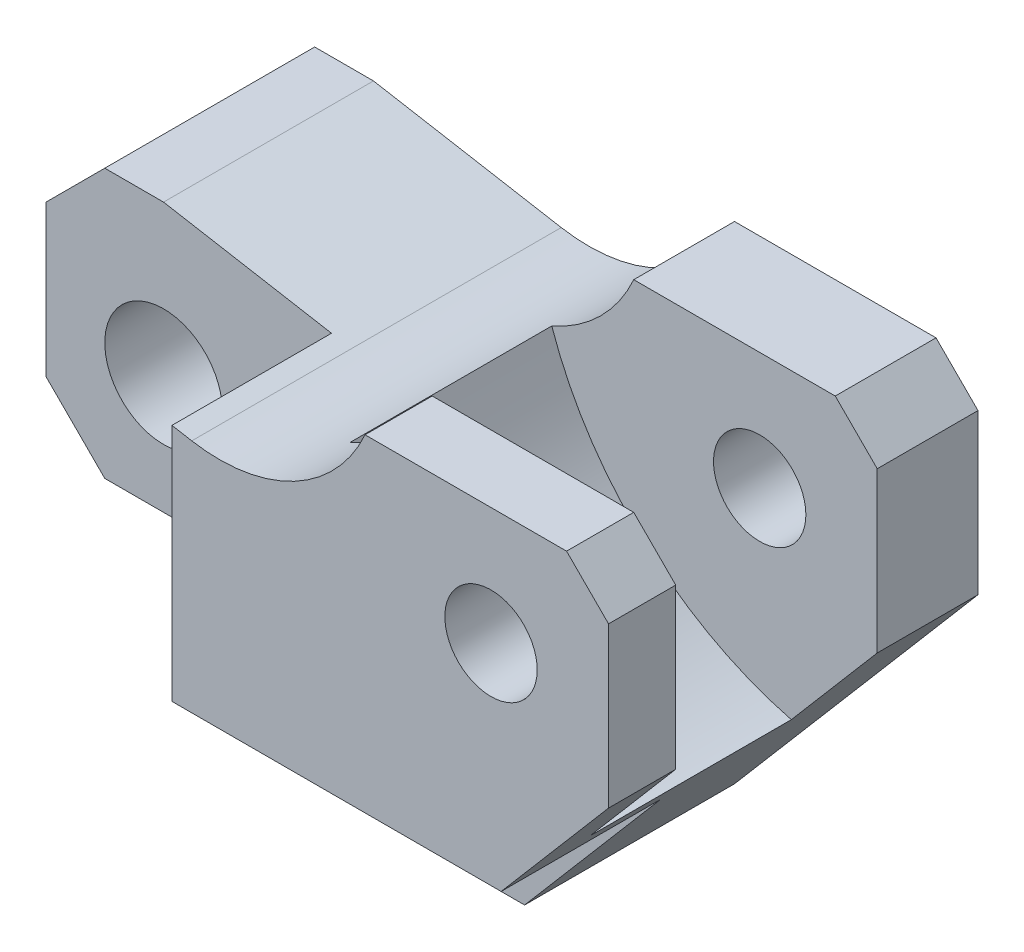
ISO-10303-21;
HEADER;
FILE_DESCRIPTION(('STEP AP214'),'2;1');
FILE_NAME('part.step','',(''),(''),'','','');
FILE_SCHEMA(('AUTOMOTIVE_DESIGN { 1 0 10303 214 1 1 1 1 }'));
ENDSEC;
DATA;
#1=APPLICATION_CONTEXT('core data for automotive mechanical design processes');
#2=APPLICATION_PROTOCOL_DEFINITION('international standard','automotive_design',2000,#1);
#3=PRODUCT_CONTEXT('',#1,'mechanical');
#4=PRODUCT('Part','Part','',(#3));
#5=PRODUCT_RELATED_PRODUCT_CATEGORY('part','',(#4));
#6=PRODUCT_DEFINITION_FORMATION('','',#4);
#7=PRODUCT_DEFINITION_CONTEXT('part definition',#1,'design');
#8=PRODUCT_DEFINITION('design','',#6,#7);
#9=PRODUCT_DEFINITION_SHAPE('','',#8);
#10=(LENGTH_UNIT() NAMED_UNIT(*) SI_UNIT(.MILLI.,.METRE.));
#11=(NAMED_UNIT(*) PLANE_ANGLE_UNIT() SI_UNIT($,.RADIAN.));
#12=(NAMED_UNIT(*) SI_UNIT($,.STERADIAN.) SOLID_ANGLE_UNIT());
#13=UNCERTAINTY_MEASURE_WITH_UNIT(LENGTH_MEASURE(1.E-05),#10,'distance_accuracy_value','');
#14=(GEOMETRIC_REPRESENTATION_CONTEXT(3) GLOBAL_UNCERTAINTY_ASSIGNED_CONTEXT((#13)) GLOBAL_UNIT_ASSIGNED_CONTEXT((#10,
#11,#12)) REPRESENTATION_CONTEXT('',''));
#15=CARTESIAN_POINT('',(0.,0.,0.));
#16=DIRECTION('',(0.,0.,1.));
#17=DIRECTION('',(1.,0.,0.));
#18=AXIS2_PLACEMENT_3D('',#15,#16,#17);
#19=CARTESIAN_POINT('',(-17.3393037885512,65.7684325399872,-44.));
#20=DIRECTION('',(0.,0.,1.));
#21=DIRECTION('',(1.,0.,0.));
#22=AXIS2_PLACEMENT_3D('',#19,#20,#21);
#23=CYLINDRICAL_SURFACE('',#22,19.);
#24=CARTESIAN_POINT('',(-17.3393037885512,65.7684325399872,-32.));
#25=DIRECTION('',(0.,0.,1.));
#26=DIRECTION('',(1.,0.,0.));
#27=AXIS2_PLACEMENT_3D('',#24,#25,#26);
#28=CIRCLE('',#27,19.);
#29=CARTESIAN_POINT('',(-9.76306345097571,48.344294617344,-32.));
#30=VERTEX_POINT('',#29);
#31=CARTESIAN_POINT('',(0.,58.,-32.));
#32=VERTEX_POINT('',#31);
#33=EDGE_CURVE('E245',#30,#32,#28,.T.);
#34=ORIENTED_EDGE('',*,*,#33,.T.);
#35=DIRECTION('',(0.,0.,1.));
#36=VECTOR('',#35,1.);
#37=CARTESIAN_POINT('',(0.,58.,-44.));
#38=LINE('',#37,#36);
#39=CARTESIAN_POINT('',(0.,58.,-44.));
#40=VERTEX_POINT('',#39);
#41=EDGE_CURVE('E412',#40,#32,#38,.T.);
#42=ORIENTED_EDGE('',*,*,#41,.F.);
#43=CARTESIAN_POINT('',(-17.3393037885512,65.7684325399872,-44.));
#44=DIRECTION('',(0.,0.,1.));
#45=DIRECTION('',(1.,0.,0.));
#46=AXIS2_PLACEMENT_3D('',#43,#44,#45);
#47=CIRCLE('',#46,19.);
#48=CARTESIAN_POINT('',(-20.6386191642229,47.0570852327553,-44.));
#49=VERTEX_POINT('',#48);
#50=EDGE_CURVE('E340',#49,#40,#47,.T.);
#51=ORIENTED_EDGE('',*,*,#50,.F.);
#52=DIRECTION('',(0.,0.,1.));
#53=VECTOR('',#52,1.);
#54=CARTESIAN_POINT('',(-20.6386191642229,47.0570852327553,-44.));
#55=LINE('',#54,#53);
#56=CARTESIAN_POINT('',(-20.6386191642229,47.0570852327553,0.));
#57=VERTEX_POINT('',#56);
#58=EDGE_CURVE('E414',#49,#57,#55,.T.);
#59=ORIENTED_EDGE('',*,*,#58,.T.);
#60=CARTESIAN_POINT('',(-17.3393037885512,65.7684325399872,0.));
#61=DIRECTION('',(0.,0.,1.));
#62=DIRECTION('',(1.,0.,0.));
#63=AXIS2_PLACEMENT_3D('',#60,#61,#62);
#64=CIRCLE('',#63,19.);
#65=CARTESIAN_POINT('',(0.,58.,0.));
#66=VERTEX_POINT('',#65);
#67=EDGE_CURVE('E367',#57,#66,#64,.T.);
#68=ORIENTED_EDGE('',*,*,#67,.T.);
#69=CARTESIAN_POINT('',(0.,58.,-8.));
#70=VERTEX_POINT('',#69);
#71=EDGE_CURVE('E411',#70,#66,#38,.T.);
#72=ORIENTED_EDGE('',*,*,#71,.F.);
#73=CARTESIAN_POINT('',(-17.3393037885512,65.7684325399872,-8.));
#74=DIRECTION('',(0.,0.,1.));
#75=DIRECTION('',(1.,0.,0.));
#76=AXIS2_PLACEMENT_3D('',#73,#74,#75);
#77=CIRCLE('',#76,19.);
#78=CARTESIAN_POINT('',(-9.76306345097571,48.344294617344,-8.));
#79=VERTEX_POINT('',#78);
#80=EDGE_CURVE('E269',#79,#70,#77,.T.);
#81=ORIENTED_EDGE('',*,*,#80,.F.);
#82=DIRECTION('',(0.,0.,1.));
#83=VECTOR('',#82,1.);
#84=CARTESIAN_POINT('',(-9.76306345097571,48.344294617344,-32.));
#85=LINE('',#84,#83);
#86=EDGE_CURVE('E261',#30,#79,#85,.T.);
#87=ORIENTED_EDGE('',*,*,#86,.F.);
#88=EDGE_LOOP('',(#34,#42,#51,#59,#68,#72,#81,#87));
#89=FACE_BOUND('',#88,.T.);
#90=ADVANCED_FACE('F88',(#89),#23,.F.);
#91=CARTESIAN_POINT('',(24.,58.,-44.));
#92=DIRECTION('',(0.,1.,0.));
#93=DIRECTION('',(-1.,0.,0.));
#94=AXIS2_PLACEMENT_3D('',#91,#92,#93);
#95=PLANE('',#94);
#96=ORIENTED_EDGE('',*,*,#41,.T.);
#97=DIRECTION('',(-1.,0.,0.));
#98=VECTOR('',#97,1.);
#99=CARTESIAN_POINT('',(0.,58.,-32.));
#100=LINE('',#99,#98);
#101=CARTESIAN_POINT('',(24.,58.,-32.));
#102=VERTEX_POINT('',#101);
#103=EDGE_CURVE('E251',#102,#32,#100,.T.);
#104=ORIENTED_EDGE('',*,*,#103,.F.);
#105=DIRECTION('',(0.,0.,1.));
#106=VECTOR('',#105,1.);
#107=CARTESIAN_POINT('',(24.,58.,-44.));
#108=LINE('',#107,#106);
#109=CARTESIAN_POINT('',(24.,58.,-44.));
#110=VERTEX_POINT('',#109);
#111=EDGE_CURVE('E408',#110,#102,#108,.T.);
#112=ORIENTED_EDGE('',*,*,#111,.F.);
#113=DIRECTION('',(-1.,0.,0.));
#114=VECTOR('',#113,1.);
#115=CARTESIAN_POINT('',(24.,58.,-44.));
#116=LINE('',#115,#114);
#117=EDGE_CURVE('E342',#110,#40,#116,.T.);
#118=ORIENTED_EDGE('',*,*,#117,.T.);
#119=EDGE_LOOP('',(#96,#104,#112,#118));
#120=FACE_BOUND('',#119,.T.);
#121=ADVANCED_FACE('F517',(#120),#95,.T.);
#122=CARTESIAN_POINT('',(29.,53.,-44.));
#123=DIRECTION('',(0.707106781186549,0.707106781186546,0.));
#124=DIRECTION('',(-0.707106781186546,0.707106781186549,0.));
#125=AXIS2_PLACEMENT_3D('',#122,#123,#124);
#126=PLANE('',#125);
#127=ORIENTED_EDGE('',*,*,#111,.T.);
#128=DIRECTION('',(-0.707106781186546,0.707106781186549,0.));
#129=VECTOR('',#128,1.);
#130=CARTESIAN_POINT('',(41.0000000000001,40.9999999999999,-32.));
#131=LINE('',#130,#129);
#132=CARTESIAN_POINT('',(29.,53.,-32.));
#133=VERTEX_POINT('',#132);
#134=EDGE_CURVE('E273',#133,#102,#131,.T.);
#135=ORIENTED_EDGE('',*,*,#134,.F.);
#136=DIRECTION('',(0.,0.,1.));
#137=VECTOR('',#136,1.);
#138=CARTESIAN_POINT('',(29.,53.,-44.));
#139=LINE('',#138,#137);
#140=CARTESIAN_POINT('',(29.,53.,-44.));
#141=VERTEX_POINT('',#140);
#142=EDGE_CURVE('E404',#141,#133,#139,.T.);
#143=ORIENTED_EDGE('',*,*,#142,.F.);
#144=DIRECTION('',(-0.707106781186546,0.707106781186549,0.));
#145=VECTOR('',#144,1.);
#146=CARTESIAN_POINT('',(29.,53.,-44.));
#147=LINE('',#146,#145);
#148=EDGE_CURVE('E345',#141,#110,#147,.T.);
#149=ORIENTED_EDGE('',*,*,#148,.T.);
#150=EDGE_LOOP('',(#127,#135,#143,#149));
#151=FACE_BOUND('',#150,.T.);
#152=ADVANCED_FACE('F515',(#151),#126,.T.);
#153=CARTESIAN_POINT('',(29.,34.,-44.));
#154=DIRECTION('',(1.,0.,0.));
#155=DIRECTION('',(0.,1.,0.));
#156=AXIS2_PLACEMENT_3D('',#153,#154,#155);
#157=PLANE('',#156);
#158=ORIENTED_EDGE('',*,*,#142,.T.);
#159=DIRECTION('',(0.,1.,0.));
#160=VECTOR('',#159,1.);
#161=CARTESIAN_POINT('',(29.,0.,-32.));
#162=LINE('',#161,#160);
#163=CARTESIAN_POINT('',(29.,34.,-32.));
#164=VERTEX_POINT('',#163);
#165=EDGE_CURVE('E507',#164,#133,#162,.T.);
#166=ORIENTED_EDGE('',*,*,#165,.F.);
#167=DIRECTION('',(0.,0.,1.));
#168=VECTOR('',#167,1.);
#169=CARTESIAN_POINT('',(29.,34.,-44.));
#170=LINE('',#169,#168);
#171=CARTESIAN_POINT('',(29.,34.,-44.));
#172=VERTEX_POINT('',#171);
#173=EDGE_CURVE('E400',#172,#164,#170,.T.);
#174=ORIENTED_EDGE('',*,*,#173,.F.);
#175=DIRECTION('',(0.,1.,0.));
#176=VECTOR('',#175,1.);
#177=CARTESIAN_POINT('',(29.,34.,-44.));
#178=LINE('',#177,#176);
#179=EDGE_CURVE('E348',#172,#141,#178,.T.);
#180=ORIENTED_EDGE('',*,*,#179,.T.);
#181=EDGE_LOOP('',(#158,#166,#174,#180));
#182=FACE_BOUND('',#181,.T.);
#183=ADVANCED_FACE('F512',(#182),#157,.T.);
#184=CARTESIAN_POINT('',(0.,0.,-44.));
#185=DIRECTION('',(0.760833951959086,-0.64894660608275,0.));
#186=DIRECTION('',(0.64894660608275,0.760833951959086,0.));
#187=AXIS2_PLACEMENT_3D('',#184,#185,#186);
#188=PLANE('',#187);
#189=ORIENTED_EDGE('',*,*,#173,.T.);
#190=DIRECTION('',(0.64894660608275,0.760833951959086,0.));
#191=VECTOR('',#190,1.);
#192=CARTESIAN_POINT('',(0.,0.,-32.));
#193=LINE('',#192,#191);
#194=CARTESIAN_POINT('',(18.764705882353,22.,-32.));
#195=VERTEX_POINT('',#194);
#196=EDGE_CURVE('E265',#195,#164,#193,.T.);
#197=ORIENTED_EDGE('',*,*,#196,.F.);
#198=DIRECTION('',(0.,0.,1.));
#199=VECTOR('',#198,1.);
#200=CARTESIAN_POINT('',(18.764705882353,22.,-32.));
#201=LINE('',#200,#199);
#202=CARTESIAN_POINT('',(18.764705882353,22.,-8.));
#203=VERTEX_POINT('',#202);
#204=EDGE_CURVE('E264',#195,#203,#201,.T.);
#205=ORIENTED_EDGE('',*,*,#204,.T.);
#206=DIRECTION('',(0.64894660608275,0.760833951959086,0.));
#207=VECTOR('',#206,1.);
#208=CARTESIAN_POINT('',(0.,0.,-8.));
#209=LINE('',#208,#207);
#210=CARTESIAN_POINT('',(29.,34.,-8.));
#211=VERTEX_POINT('',#210);
#212=EDGE_CURVE('E498',#203,#211,#209,.T.);
#213=ORIENTED_EDGE('',*,*,#212,.T.);
#214=CARTESIAN_POINT('',(29.,34.,0.));
#215=VERTEX_POINT('',#214);
#216=EDGE_CURVE('E399',#211,#215,#170,.T.);
#217=ORIENTED_EDGE('',*,*,#216,.T.);
#218=DIRECTION('',(0.64894660608275,0.760833951959086,0.));
#219=VECTOR('',#218,1.);
#220=CARTESIAN_POINT('',(0.,0.,0.));
#221=LINE('',#220,#219);
#222=CARTESIAN_POINT('',(16.2058823529412,19.,0.));
#223=VERTEX_POINT('',#222);
#224=EDGE_CURVE('E379',#223,#215,#221,.T.);
#225=ORIENTED_EDGE('',*,*,#224,.F.);
#226=DIRECTION('',(0.,0.,1.));
#227=VECTOR('',#226,1.);
#228=CARTESIAN_POINT('',(16.2058823529412,19.,-19.));
#229=LINE('',#228,#227);
#230=CARTESIAN_POINT('',(16.2058823529412,19.,-19.));
#231=VERTEX_POINT('',#230);
#232=EDGE_CURVE('E310',#231,#223,#229,.T.);
#233=ORIENTED_EDGE('',*,*,#232,.F.);
#234=DIRECTION('',(0.64894660608275,0.760833951959086,0.));
#235=VECTOR('',#234,1.);
#236=CARTESIAN_POINT('',(0.,0.,-19.));
#237=LINE('',#236,#235);
#238=CARTESIAN_POINT('',(0.,0.,-19.));
#239=VERTEX_POINT('',#238);
#240=EDGE_CURVE('E323',#239,#231,#237,.T.);
#241=ORIENTED_EDGE('',*,*,#240,.F.);
#242=DIRECTION('',(0.,0.,1.));
#243=VECTOR('',#242,1.);
#244=CARTESIAN_POINT('',(0.,0.,-44.));
#245=LINE('',#244,#243);
#246=CARTESIAN_POINT('',(0.,0.,-44.));
#247=VERTEX_POINT('',#246);
#248=EDGE_CURVE('E396',#247,#239,#245,.T.);
#249=ORIENTED_EDGE('',*,*,#248,.F.);
#250=DIRECTION('',(0.64894660608275,0.760833951959086,0.));
#251=VECTOR('',#250,1.);
#252=CARTESIAN_POINT('',(0.,0.,-44.));
#253=LINE('',#252,#251);
#254=EDGE_CURVE('E351',#247,#172,#253,.T.);
#255=ORIENTED_EDGE('',*,*,#254,.T.);
#256=EDGE_LOOP('',(#189,#197,#205,#213,#217,#225,#233,#241,#249,#255));
#257=FACE_BOUND('',#256,.T.);
#258=ADVANCED_FACE('F475',(#257),#188,.T.);
#259=CARTESIAN_POINT('',(15.,44.,-44.));
#260=DIRECTION('',(0.,0.,1.));
#261=DIRECTION('',(1.,0.,0.));
#262=AXIS2_PLACEMENT_3D('',#259,#260,#261);
#263=CYLINDRICAL_SURFACE('',#262,5.5);
#264=CARTESIAN_POINT('',(15.,44.,-44.));
#265=DIRECTION('',(0.,0.,1.));
#266=DIRECTION('',(1.,0.,0.));
#267=AXIS2_PLACEMENT_3D('',#264,#265,#266);
#268=CIRCLE('',#267,5.5);
#269=CARTESIAN_POINT('',(20.5,44.,-44.));
#270=VERTEX_POINT('',#269);
#271=EDGE_CURVE('E277',#270,#270,#268,.T.);
#272=ORIENTED_EDGE('',*,*,#271,.F.);
#273=EDGE_LOOP('',(#272));
#274=FACE_BOUND('',#273,.T.);
#275=CARTESIAN_POINT('',(15.,44.,-32.));
#276=DIRECTION('',(0.,0.,1.));
#277=DIRECTION('',(1.,0.,0.));
#278=AXIS2_PLACEMENT_3D('',#275,#276,#277);
#279=CIRCLE('',#278,5.5);
#280=CARTESIAN_POINT('',(20.5,44.,-32.));
#281=VERTEX_POINT('',#280);
#282=EDGE_CURVE('E256',#281,#281,#279,.T.);
#283=ORIENTED_EDGE('',*,*,#282,.T.);
#284=EDGE_LOOP('',(#283));
#285=FACE_BOUND('',#284,.T.);
#286=ADVANCED_FACE('F561',(#274,#285),#263,.F.);
#287=CARTESIAN_POINT('',(-57.,26.,-44.));
#288=DIRECTION('',(1.,0.,0.));
#289=DIRECTION('',(0.,1.,0.));
#290=AXIS2_PLACEMENT_3D('',#287,#288,#289);
#291=PLANE('',#290);
#292=DIRECTION('',(0.,1.,0.));
#293=VECTOR('',#292,1.);
#294=CARTESIAN_POINT('',(-57.,0.,-19.));
#295=LINE('',#294,#293);
#296=CARTESIAN_POINT('',(-57.,26.,-19.));
#297=VERTEX_POINT('',#296);
#298=CARTESIAN_POINT('',(-57.,44.,-19.));
#299=VERTEX_POINT('',#298);
#300=EDGE_CURVE('E299',#297,#299,#295,.T.);
#301=ORIENTED_EDGE('',*,*,#300,.T.);
#302=DIRECTION('',(0.,0.,1.));
#303=VECTOR('',#302,1.);
#304=CARTESIAN_POINT('',(-57.,44.,-44.));
#305=LINE('',#304,#303);
#306=CARTESIAN_POINT('',(-57.,44.,-44.));
#307=VERTEX_POINT('',#306);
#308=EDGE_CURVE('E12',#307,#299,#305,.T.);
#309=ORIENTED_EDGE('',*,*,#308,.F.);
#310=DIRECTION('',(0.,1.,0.));
#311=VECTOR('',#310,1.);
#312=CARTESIAN_POINT('',(-57.,26.,-44.));
#313=LINE('',#312,#311);
#314=CARTESIAN_POINT('',(-57.,26.,-44.));
#315=VERTEX_POINT('',#314);
#316=EDGE_CURVE('E331',#315,#307,#313,.T.);
#317=ORIENTED_EDGE('',*,*,#316,.F.);
#318=DIRECTION('',(0.,0.,1.));
#319=VECTOR('',#318,1.);
#320=CARTESIAN_POINT('',(-57.,26.,-44.));
#321=LINE('',#320,#319);
#322=EDGE_CURVE('E365',#315,#297,#321,.T.);
#323=ORIENTED_EDGE('',*,*,#322,.T.);
#324=EDGE_LOOP('',(#301,#309,#317,#323));
#325=FACE_BOUND('',#324,.T.);
#326=ADVANCED_FACE('F90',(#325),#291,.F.);
#327=CARTESIAN_POINT('',(-57.,44.,-44.));
#328=DIRECTION('',(0.707106781186549,-0.707106781186546,0.));
#329=DIRECTION('',(0.707106781186546,0.707106781186549,0.));
#330=AXIS2_PLACEMENT_3D('',#327,#328,#329);
#331=PLANE('',#330);
#332=DIRECTION('',(0.707106781186546,0.707106781186549,0.));
#333=VECTOR('',#332,1.);
#334=CARTESIAN_POINT('',(-50.5000000000001,50.4999999999999,-19.));
#335=LINE('',#334,#333);
#336=CARTESIAN_POINT('',(-50.,51.,-19.));
#337=VERTEX_POINT('',#336);
#338=EDGE_CURVE('E296',#299,#337,#335,.T.);
#339=ORIENTED_EDGE('',*,*,#338,.T.);
#340=DIRECTION('',(0.,0.,1.));
#341=VECTOR('',#340,1.);
#342=CARTESIAN_POINT('',(-50.,51.,-44.));
#343=LINE('',#342,#341);
#344=CARTESIAN_POINT('',(-50.,51.,-44.));
#345=VERTEX_POINT('',#344);
#346=EDGE_CURVE('E96',#345,#337,#343,.T.);
#347=ORIENTED_EDGE('',*,*,#346,.F.);
#348=DIRECTION('',(0.707106781186546,0.707106781186549,0.));
#349=VECTOR('',#348,1.);
#350=CARTESIAN_POINT('',(-57.,44.,-44.));
#351=LINE('',#350,#349);
#352=EDGE_CURVE('E334',#307,#345,#351,.T.);
#353=ORIENTED_EDGE('',*,*,#352,.F.);
#354=ORIENTED_EDGE('',*,*,#308,.T.);
#355=EDGE_LOOP('',(#339,#347,#353,#354));
#356=FACE_BOUND('',#355,.T.);
#357=ADVANCED_FACE('F426',(#356),#331,.F.);
#358=CARTESIAN_POINT('',(-50.,51.,-44.));
#359=DIRECTION('',(0.,-1.,0.));
#360=DIRECTION('',(0.,0.,-1.));
#361=AXIS2_PLACEMENT_3D('',#358,#359,#360);
#362=PLANE('',#361);
#363=DIRECTION('',(1.,0.,0.));
#364=VECTOR('',#363,1.);
#365=CARTESIAN_POINT('',(0.,51.,-19.));
#366=LINE('',#365,#364);
#367=CARTESIAN_POINT('',(-43.,51.,-19.));
#368=VERTEX_POINT('',#367);
#369=EDGE_CURVE('E293',#337,#368,#366,.T.);
#370=ORIENTED_EDGE('',*,*,#369,.T.);
#371=DIRECTION('',(0.,0.,1.));
#372=VECTOR('',#371,1.);
#373=CARTESIAN_POINT('',(-43.,51.,-44.));
#374=LINE('',#373,#372);
#375=CARTESIAN_POINT('',(-43.,51.,-44.));
#376=VERTEX_POINT('',#375);
#377=EDGE_CURVE('E417',#376,#368,#374,.T.);
#378=ORIENTED_EDGE('',*,*,#377,.F.);
#379=DIRECTION('',(1.,0.,0.));
#380=VECTOR('',#379,1.);
#381=CARTESIAN_POINT('',(-50.,51.,-44.));
#382=LINE('',#381,#380);
#383=EDGE_CURVE('E336',#345,#376,#382,.T.);
#384=ORIENTED_EDGE('',*,*,#383,.F.);
#385=ORIENTED_EDGE('',*,*,#346,.T.);
#386=EDGE_LOOP('',(#370,#378,#384,#385));
#387=FACE_BOUND('',#386,.T.);
#388=ADVANCED_FACE('F423',(#387),#362,.F.);
#389=CARTESIAN_POINT('',(-43.,51.,-44.));
#390=DIRECTION('',(-0.17364817766693,-0.984807753012208,0.));
#391=DIRECTION('',(0.984807753012208,-0.17364817766693,0.));
#392=AXIS2_PLACEMENT_3D('',#389,#390,#391);
#393=PLANE('',#392);
#394=DIRECTION('',(0.,0.,1.));
#395=VECTOR('',#394,1.);
#396=CARTESIAN_POINT('',(-23.,47.4734603858307,-19.));
#397=LINE('',#396,#395);
#398=CARTESIAN_POINT('',(-23.,47.4734603858307,-19.));
#399=VERTEX_POINT('',#398);
#400=CARTESIAN_POINT('',(-23.,47.4734603858307,0.));
#401=VERTEX_POINT('',#400);
#402=EDGE_CURVE('E308',#399,#401,#397,.T.);
#403=ORIENTED_EDGE('',*,*,#402,.T.);
#404=DIRECTION('',(0.984807753012208,-0.17364817766693,0.));
#405=VECTOR('',#404,1.);
#406=CARTESIAN_POINT('',(-43.,51.,0.));
#407=LINE('',#406,#405);
#408=EDGE_CURVE('E330',#401,#57,#407,.T.);
#409=ORIENTED_EDGE('',*,*,#408,.T.);
#410=ORIENTED_EDGE('',*,*,#58,.F.);
#411=DIRECTION('',(0.984807753012208,-0.17364817766693,0.));
#412=VECTOR('',#411,1.);
#413=CARTESIAN_POINT('',(-43.,51.,-44.));
#414=LINE('',#413,#412);
#415=EDGE_CURVE('E338',#376,#49,#414,.T.);
#416=ORIENTED_EDGE('',*,*,#415,.F.);
#417=ORIENTED_EDGE('',*,*,#377,.T.);
#418=DIRECTION('',(0.984807753012208,-0.17364817766693,0.));
#419=VECTOR('',#418,1.);
#420=CARTESIAN_POINT('',(7.42490500170159,42.1087287485388,-19.));
#421=LINE('',#420,#419);
#422=EDGE_CURVE('E290',#368,#399,#421,.T.);
#423=ORIENTED_EDGE('',*,*,#422,.T.);
#424=EDGE_LOOP('',(#403,#409,#410,#416,#417,#423));
#425=FACE_BOUND('',#424,.T.);
#426=ADVANCED_FACE('F449',(#425),#393,.F.);
#427=CARTESIAN_POINT('',(0.,0.,-44.));
#428=DIRECTION('',(0.,1.,0.));
#429=DIRECTION('',(0.,0.,1.));
#430=AXIS2_PLACEMENT_3D('',#427,#428,#429);
#431=PLANE('',#430);
#432=DIRECTION('',(-1.,0.,0.));
#433=VECTOR('',#432,1.);
#434=CARTESIAN_POINT('',(0.,0.,-19.));
#435=LINE('',#434,#433);
#436=CARTESIAN_POINT('',(-5.70301994726546,0.,-19.));
#437=VERTEX_POINT('',#436);
#438=EDGE_CURVE('E320',#239,#437,#435,.T.);
#439=ORIENTED_EDGE('',*,*,#438,.T.);
#440=DIRECTION('',(0.,0.,1.));
#441=VECTOR('',#440,1.);
#442=CARTESIAN_POINT('',(-5.70301994726546,0.,-44.));
#443=LINE('',#442,#441);
#444=CARTESIAN_POINT('',(-5.70301994726546,0.,-44.));
#445=VERTEX_POINT('',#444);
#446=EDGE_CURVE('E393',#445,#437,#443,.T.);
#447=ORIENTED_EDGE('',*,*,#446,.F.);
#448=DIRECTION('',(-1.,0.,0.));
#449=VECTOR('',#448,1.);
#450=CARTESIAN_POINT('',(0.,0.,-44.));
#451=LINE('',#450,#449);
#452=EDGE_CURVE('E354',#247,#445,#451,.T.);
#453=ORIENTED_EDGE('',*,*,#452,.F.);
#454=ORIENTED_EDGE('',*,*,#248,.T.);
#455=EDGE_LOOP('',(#439,#447,#453,#454));
#456=FACE_BOUND('',#455,.T.);
#457=ADVANCED_FACE('F471',(#456),#431,.F.);
#458=CARTESIAN_POINT('',(16.2058823529412,19.,-44.));
#459=DIRECTION('',(0.,0.,1.));
#460=DIRECTION('',(1.,0.,0.));
#461=AXIS2_PLACEMENT_3D('',#458,#459,#460);
#462=CYLINDRICAL_SURFACE('',#461,29.);
#463=ORIENTED_EDGE('',*,*,#446,.T.);
#464=CARTESIAN_POINT('',(16.2058823529412,19.,-19.));
#465=DIRECTION('',(0.,0.,1.));
#466=DIRECTION('',(1.,0.,0.));
#467=AXIS2_PLACEMENT_3D('',#464,#465,#466);
#468=CIRCLE('',#467,29.);
#469=CARTESIAN_POINT('',(-12.4788223472475,14.7352941176471,-19.));
#470=VERTEX_POINT('',#469);
#471=EDGE_CURVE('E318',#470,#437,#468,.T.);
#472=ORIENTED_EDGE('',*,*,#471,.F.);
#473=DIRECTION('',(0.,0.,1.));
#474=VECTOR('',#473,1.);
#475=CARTESIAN_POINT('',(-12.4788223472475,14.7352941176471,-44.));
#476=LINE('',#475,#474);
#477=CARTESIAN_POINT('',(-12.4788223472475,14.7352941176471,-44.));
#478=VERTEX_POINT('',#477);
#479=EDGE_CURVE('E390',#478,#470,#476,.T.);
#480=ORIENTED_EDGE('',*,*,#479,.F.);
#481=CARTESIAN_POINT('',(16.2058823529412,19.,-44.));
#482=DIRECTION('',(0.,0.,1.));
#483=DIRECTION('',(1.,0.,0.));
#484=AXIS2_PLACEMENT_3D('',#481,#482,#483);
#485=CIRCLE('',#484,29.);
#486=EDGE_CURVE('E356',#478,#445,#485,.T.);
#487=ORIENTED_EDGE('',*,*,#486,.T.);
#488=EDGE_LOOP('',(#463,#472,#480,#487));
#489=FACE_BOUND('',#488,.T.);
#490=ADVANCED_FACE('F467',(#489),#462,.T.);
#491=CARTESIAN_POINT('',(-17.4244610886593,14.,-44.));
#492=DIRECTION('',(0.,0.,1.));
#493=DIRECTION('',(1.,0.,0.));
#494=AXIS2_PLACEMENT_3D('',#491,#492,#493);
#495=CYLINDRICAL_SURFACE('',#494,5.);
#496=CARTESIAN_POINT('',(-17.4244610886593,14.,-19.));
#497=DIRECTION('',(0.,0.,1.));
#498=DIRECTION('',(1.,0.,0.));
#499=AXIS2_PLACEMENT_3D('',#496,#497,#498);
#500=CIRCLE('',#499,5.);
#501=CARTESIAN_POINT('',(-17.4244610886593,19.,-19.));
#502=VERTEX_POINT('',#501);
#503=EDGE_CURVE('E280',#470,#502,#500,.T.);
#504=ORIENTED_EDGE('',*,*,#503,.T.);
#505=DIRECTION('',(0.,0.,1.));
#506=VECTOR('',#505,1.);
#507=CARTESIAN_POINT('',(-17.4244610886593,19.,-44.));
#508=LINE('',#507,#506);
#509=CARTESIAN_POINT('',(-17.4244610886593,19.,-44.));
#510=VERTEX_POINT('',#509);
#511=EDGE_CURVE('E387',#510,#502,#508,.T.);
#512=ORIENTED_EDGE('',*,*,#511,.F.);
#513=CARTESIAN_POINT('',(-17.4244610886593,14.,-44.));
#514=DIRECTION('',(0.,0.,1.));
#515=DIRECTION('',(1.,0.,0.));
#516=AXIS2_PLACEMENT_3D('',#513,#514,#515);
#517=CIRCLE('',#516,5.);
#518=EDGE_CURVE('E359',#478,#510,#517,.T.);
#519=ORIENTED_EDGE('',*,*,#518,.F.);
#520=ORIENTED_EDGE('',*,*,#479,.T.);
#521=EDGE_LOOP('',(#504,#512,#519,#520));
#522=FACE_BOUND('',#521,.T.);
#523=ADVANCED_FACE('F462',(#522),#495,.F.);
#524=CARTESIAN_POINT('',(-17.4244610886593,19.,-44.));
#525=DIRECTION('',(0.,1.,0.));
#526=DIRECTION('',(0.,0.,1.));
#527=AXIS2_PLACEMENT_3D('',#524,#525,#526);
#528=PLANE('',#527);
#529=DIRECTION('',(0.,0.,1.));
#530=VECTOR('',#529,1.);
#531=CARTESIAN_POINT('',(-23.,19.,-19.));
#532=LINE('',#531,#530);
#533=CARTESIAN_POINT('',(-23.,19.,-19.));
#534=VERTEX_POINT('',#533);
#535=CARTESIAN_POINT('',(-23.,19.,0.));
#536=VERTEX_POINT('',#535);
#537=EDGE_CURVE('E311',#534,#536,#532,.T.);
#538=ORIENTED_EDGE('',*,*,#537,.F.);
#539=DIRECTION('',(-1.,0.,0.));
#540=VECTOR('',#539,1.);
#541=CARTESIAN_POINT('',(0.,19.,-19.));
#542=LINE('',#541,#540);
#543=CARTESIAN_POINT('',(-50.,19.,-19.));
#544=VERTEX_POINT('',#543);
#545=EDGE_CURVE('E305',#534,#544,#542,.T.);
#546=ORIENTED_EDGE('',*,*,#545,.T.);
#547=DIRECTION('',(0.,0.,1.));
#548=VECTOR('',#547,1.);
#549=CARTESIAN_POINT('',(-50.,19.,-44.));
#550=LINE('',#549,#548);
#551=CARTESIAN_POINT('',(-50.,19.,-44.));
#552=VERTEX_POINT('',#551);
#553=EDGE_CURVE('E384',#552,#544,#550,.T.);
#554=ORIENTED_EDGE('',*,*,#553,.F.);
#555=DIRECTION('',(-1.,0.,0.));
#556=VECTOR('',#555,1.);
#557=CARTESIAN_POINT('',(-17.4244610886593,19.,-44.));
#558=LINE('',#557,#556);
#559=EDGE_CURVE('E361',#510,#552,#558,.T.);
#560=ORIENTED_EDGE('',*,*,#559,.F.);
#561=ORIENTED_EDGE('',*,*,#511,.T.);
#562=DIRECTION('',(-1.,0.,0.));
#563=VECTOR('',#562,1.);
#564=CARTESIAN_POINT('',(0.,19.,-19.));
#565=LINE('',#564,#563);
#566=EDGE_CURVE('E325',#231,#502,#565,.T.);
#567=ORIENTED_EDGE('',*,*,#566,.F.);
#568=ORIENTED_EDGE('',*,*,#232,.T.);
#569=DIRECTION('',(-1.,0.,0.));
#570=VECTOR('',#569,1.);
#571=CARTESIAN_POINT('',(-17.4244610886593,19.,0.));
#572=LINE('',#571,#570);
#573=EDGE_CURVE('E111',#223,#536,#572,.T.);
#574=ORIENTED_EDGE('',*,*,#573,.T.);
#575=EDGE_LOOP('',(#538,#546,#554,#560,#561,#567,#568,#574));
#576=FACE_BOUND('',#575,.T.);
#577=ADVANCED_FACE('F440',(#576),#528,.F.);
#578=CARTESIAN_POINT('',(-50.,19.,-44.));
#579=DIRECTION('',(0.707106781186548,0.707106781186547,0.));
#580=DIRECTION('',(-0.707106781186547,0.707106781186548,0.));
#581=AXIS2_PLACEMENT_3D('',#578,#579,#580);
#582=PLANE('',#581);
#583=DIRECTION('',(-0.707106781186547,0.707106781186548,0.));
#584=VECTOR('',#583,1.);
#585=CARTESIAN_POINT('',(-15.5,-15.5,-19.));
#586=LINE('',#585,#584);
#587=EDGE_CURVE('E302',#544,#297,#586,.T.);
#588=ORIENTED_EDGE('',*,*,#587,.T.);
#589=ORIENTED_EDGE('',*,*,#322,.F.);
#590=DIRECTION('',(-0.707106781186547,0.707106781186548,0.));
#591=VECTOR('',#590,1.);
#592=CARTESIAN_POINT('',(-50.,19.,-44.));
#593=LINE('',#592,#591);
#594=EDGE_CURVE('E363',#552,#315,#593,.T.);
#595=ORIENTED_EDGE('',*,*,#594,.F.);
#596=ORIENTED_EDGE('',*,*,#553,.T.);
#597=EDGE_LOOP('',(#588,#589,#595,#596));
#598=FACE_BOUND('',#597,.T.);
#599=ADVANCED_FACE('F436',(#598),#582,.F.);
#600=CARTESIAN_POINT('',(-17.3393037885512,65.7684325399872,0.));
#601=DIRECTION('',(0.,0.,1.));
#602=DIRECTION('',(1.,0.,0.));
#603=AXIS2_PLACEMENT_3D('',#600,#601,#602);
#604=PLANE('',#603);
#605=CARTESIAN_POINT('',(15.,44.,0.));
#606=DIRECTION('',(0.,0.,1.));
#607=DIRECTION('',(1.,0.,0.));
#608=AXIS2_PLACEMENT_3D('',#605,#606,#607);
#609=CIRCLE('',#608,5.5);
#610=CARTESIAN_POINT('',(20.5,44.,0.));
#611=VERTEX_POINT('',#610);
#612=EDGE_CURVE('E271',#611,#611,#609,.T.);
#613=ORIENTED_EDGE('',*,*,#612,.F.);
#614=EDGE_LOOP('',(#613));
#615=FACE_BOUND('',#614,.T.);
#616=ORIENTED_EDGE('',*,*,#408,.F.);
#617=DIRECTION('',(0.,-1.,0.));
#618=VECTOR('',#617,1.);
#619=CARTESIAN_POINT('',(-23.,0.,0.));
#620=LINE('',#619,#618);
#621=EDGE_CURVE('E287',#401,#536,#620,.T.);
#622=ORIENTED_EDGE('',*,*,#621,.T.);
#623=ORIENTED_EDGE('',*,*,#573,.F.);
#624=ORIENTED_EDGE('',*,*,#224,.T.);
#625=DIRECTION('',(0.,1.,0.));
#626=VECTOR('',#625,1.);
#627=CARTESIAN_POINT('',(29.,34.,0.));
#628=LINE('',#627,#626);
#629=CARTESIAN_POINT('',(29.,53.,0.));
#630=VERTEX_POINT('',#629);
#631=EDGE_CURVE('E376',#215,#630,#628,.T.);
#632=ORIENTED_EDGE('',*,*,#631,.T.);
#633=DIRECTION('',(-0.707106781186546,0.707106781186549,0.));
#634=VECTOR('',#633,1.);
#635=CARTESIAN_POINT('',(29.,53.,0.));
#636=LINE('',#635,#634);
#637=CARTESIAN_POINT('',(24.,58.,0.));
#638=VERTEX_POINT('',#637);
#639=EDGE_CURVE('E373',#630,#638,#636,.T.);
#640=ORIENTED_EDGE('',*,*,#639,.T.);
#641=DIRECTION('',(-1.,0.,0.));
#642=VECTOR('',#641,1.);
#643=CARTESIAN_POINT('',(24.,58.,0.));
#644=LINE('',#643,#642);
#645=EDGE_CURVE('E370',#638,#66,#644,.T.);
#646=ORIENTED_EDGE('',*,*,#645,.T.);
#647=ORIENTED_EDGE('',*,*,#67,.F.);
#648=EDGE_LOOP('',(#616,#622,#623,#624,#632,#640,#646,#647));
#649=FACE_BOUND('',#648,.T.);
#650=ADVANCED_FACE('F445',(#615,#649),#604,.T.);
#651=CARTESIAN_POINT('',(-43.,33.,-44.));
#652=DIRECTION('',(0.,0.,1.));
#653=DIRECTION('',(1.,0.,0.));
#654=AXIS2_PLACEMENT_3D('',#651,#652,#653);
#655=CYLINDRICAL_SURFACE('',#654,7.);
#656=CARTESIAN_POINT('',(-43.,33.,-44.));
#657=DIRECTION('',(0.,0.,1.));
#658=DIRECTION('',(1.,0.,0.));
#659=AXIS2_PLACEMENT_3D('',#656,#657,#658);
#660=CIRCLE('',#659,7.);
#661=CARTESIAN_POINT('',(-36.,33.,-44.));
#662=VERTEX_POINT('',#661);
#663=EDGE_CURVE('E313',#662,#662,#660,.T.);
#664=ORIENTED_EDGE('',*,*,#663,.F.);
#665=EDGE_LOOP('',(#664));
#666=FACE_BOUND('',#665,.T.);
#667=CARTESIAN_POINT('',(-43.,33.,-19.));
#668=DIRECTION('',(0.,0.,1.));
#669=DIRECTION('',(1.,0.,0.));
#670=AXIS2_PLACEMENT_3D('',#667,#668,#669);
#671=CIRCLE('',#670,7.);
#672=CARTESIAN_POINT('',(-36.,33.,-19.));
#673=VERTEX_POINT('',#672);
#674=EDGE_CURVE('E283',#673,#673,#671,.T.);
#675=ORIENTED_EDGE('',*,*,#674,.T.);
#676=EDGE_LOOP('',(#675));
#677=FACE_BOUND('',#676,.T.);
#678=ADVANCED_FACE('F527',(#666,#677),#655,.F.);
#679=DIRECTION('',(-1.,0.,0.));
#680=VECTOR('',#679,1.);
#681=CARTESIAN_POINT('',(0.,58.,-8.));
#682=LINE('',#681,#680);
#683=CARTESIAN_POINT('',(24.,58.,-8.));
#684=VERTEX_POINT('',#683);
#685=EDGE_CURVE('E491',#684,#70,#682,.T.);
#686=ORIENTED_EDGE('',*,*,#685,.T.);
#687=ORIENTED_EDGE('',*,*,#71,.T.);
#688=ORIENTED_EDGE('',*,*,#645,.F.);
#689=EDGE_CURVE('E407',#684,#638,#108,.T.);
#690=ORIENTED_EDGE('',*,*,#689,.F.);
#691=EDGE_LOOP('',(#686,#687,#688,#690));
#692=FACE_BOUND('',#691,.T.);
#693=ADVANCED_FACE('F490',(#692),#95,.T.);
#694=DIRECTION('',(-0.707106781186546,0.707106781186549,0.));
#695=VECTOR('',#694,1.);
#696=CARTESIAN_POINT('',(41.0000000000001,40.9999999999999,-8.));
#697=LINE('',#696,#695);
#698=CARTESIAN_POINT('',(29.,53.,-8.));
#699=VERTEX_POINT('',#698);
#700=EDGE_CURVE('E492',#699,#684,#697,.T.);
#701=ORIENTED_EDGE('',*,*,#700,.T.);
#702=ORIENTED_EDGE('',*,*,#689,.T.);
#703=ORIENTED_EDGE('',*,*,#639,.F.);
#704=EDGE_CURVE('E403',#699,#630,#139,.T.);
#705=ORIENTED_EDGE('',*,*,#704,.F.);
#706=EDGE_LOOP('',(#701,#702,#703,#705));
#707=FACE_BOUND('',#706,.T.);
#708=ADVANCED_FACE('F485',(#707),#126,.T.);
#709=DIRECTION('',(0.,1.,0.));
#710=VECTOR('',#709,1.);
#711=CARTESIAN_POINT('',(29.,0.,-8.));
#712=LINE('',#711,#710);
#713=EDGE_CURVE('E103',#211,#699,#712,.T.);
#714=ORIENTED_EDGE('',*,*,#713,.T.);
#715=ORIENTED_EDGE('',*,*,#704,.T.);
#716=ORIENTED_EDGE('',*,*,#631,.F.);
#717=ORIENTED_EDGE('',*,*,#216,.F.);
#718=EDGE_LOOP('',(#714,#715,#716,#717));
#719=FACE_BOUND('',#718,.T.);
#720=ADVANCED_FACE('F480',(#719),#157,.T.);
#721=CARTESIAN_POINT('',(-17.3393037885512,65.7684325399872,-44.));
#722=DIRECTION('',(0.,0.,1.));
#723=DIRECTION('',(1.,0.,0.));
#724=AXIS2_PLACEMENT_3D('',#721,#722,#723);
#725=PLANE('',#724);
#726=ORIENTED_EDGE('',*,*,#271,.T.);
#727=EDGE_LOOP('',(#726));
#728=FACE_BOUND('',#727,.T.);
#729=ORIENTED_EDGE('',*,*,#663,.T.);
#730=EDGE_LOOP('',(#729));
#731=FACE_BOUND('',#730,.T.);
#732=ORIENTED_EDGE('',*,*,#316,.T.);
#733=ORIENTED_EDGE('',*,*,#352,.T.);
#734=ORIENTED_EDGE('',*,*,#383,.T.);
#735=ORIENTED_EDGE('',*,*,#415,.T.);
#736=ORIENTED_EDGE('',*,*,#50,.T.);
#737=ORIENTED_EDGE('',*,*,#117,.F.);
#738=ORIENTED_EDGE('',*,*,#148,.F.);
#739=ORIENTED_EDGE('',*,*,#179,.F.);
#740=ORIENTED_EDGE('',*,*,#254,.F.);
#741=ORIENTED_EDGE('',*,*,#452,.T.);
#742=ORIENTED_EDGE('',*,*,#486,.F.);
#743=ORIENTED_EDGE('',*,*,#518,.T.);
#744=ORIENTED_EDGE('',*,*,#559,.T.);
#745=ORIENTED_EDGE('',*,*,#594,.T.);
#746=EDGE_LOOP('',(#732,#733,#734,#735,#736,#737,#738,#739,#740,#741,#742,#743,#744,#745));
#747=FACE_BOUND('',#746,.T.);
#748=ADVANCED_FACE('F454',(#728,#731,#747),#725,.F.);
#749=CARTESIAN_POINT('',(-23.,0.,-19.));
#750=DIRECTION('',(-1.,0.,0.));
#751=DIRECTION('',(0.,-1.,0.));
#752=AXIS2_PLACEMENT_3D('',#749,#750,#751);
#753=PLANE('',#752);
#754=ORIENTED_EDGE('',*,*,#621,.F.);
#755=ORIENTED_EDGE('',*,*,#402,.F.);
#756=DIRECTION('',(0.,-1.,0.));
#757=VECTOR('',#756,1.);
#758=CARTESIAN_POINT('',(-23.,0.,-19.));
#759=LINE('',#758,#757);
#760=EDGE_CURVE('E286',#399,#534,#759,.T.);
#761=ORIENTED_EDGE('',*,*,#760,.T.);
#762=ORIENTED_EDGE('',*,*,#537,.T.);
#763=EDGE_LOOP('',(#754,#755,#761,#762));
#764=FACE_BOUND('',#763,.T.);
#765=ADVANCED_FACE('F443',(#764),#753,.T.);
#766=CARTESIAN_POINT('',(0.,0.,-19.));
#767=DIRECTION('',(0.,0.,1.));
#768=DIRECTION('',(1.,0.,0.));
#769=AXIS2_PLACEMENT_3D('',#766,#767,#768);
#770=PLANE('',#769);
#771=ORIENTED_EDGE('',*,*,#674,.F.);
#772=EDGE_LOOP('',(#771));
#773=FACE_BOUND('',#772,.T.);
#774=ORIENTED_EDGE('',*,*,#760,.F.);
#775=ORIENTED_EDGE('',*,*,#422,.F.);
#776=ORIENTED_EDGE('',*,*,#369,.F.);
#777=ORIENTED_EDGE('',*,*,#338,.F.);
#778=ORIENTED_EDGE('',*,*,#300,.F.);
#779=ORIENTED_EDGE('',*,*,#587,.F.);
#780=ORIENTED_EDGE('',*,*,#545,.F.);
#781=EDGE_LOOP('',(#774,#775,#776,#777,#778,#779,#780));
#782=FACE_BOUND('',#781,.T.);
#783=ADVANCED_FACE('F430',(#773,#782),#770,.T.);
#784=CARTESIAN_POINT('',(0.,0.,-19.));
#785=DIRECTION('',(0.,0.,1.));
#786=DIRECTION('',(1.,0.,0.));
#787=AXIS2_PLACEMENT_3D('',#784,#785,#786);
#788=PLANE('',#787);
#789=ORIENTED_EDGE('',*,*,#503,.F.);
#790=ORIENTED_EDGE('',*,*,#471,.T.);
#791=ORIENTED_EDGE('',*,*,#438,.F.);
#792=ORIENTED_EDGE('',*,*,#240,.T.);
#793=ORIENTED_EDGE('',*,*,#566,.T.);
#794=EDGE_LOOP('',(#789,#790,#791,#792,#793));
#795=FACE_BOUND('',#794,.T.);
#796=ADVANCED_FACE('F465',(#795),#788,.T.);
#797=CARTESIAN_POINT('',(15.,44.,-8.));
#798=DIRECTION('',(0.,0.,1.));
#799=DIRECTION('',(1.,0.,0.));
#800=AXIS2_PLACEMENT_3D('',#797,#798,#799);
#801=CIRCLE('',#800,5.5);
#802=CARTESIAN_POINT('',(20.5,44.,-8.));
#803=VERTEX_POINT('',#802);
#804=EDGE_CURVE('E503',#803,#803,#801,.T.);
#805=ORIENTED_EDGE('',*,*,#804,.F.);
#806=EDGE_LOOP('',(#805));
#807=FACE_BOUND('',#806,.T.);
#808=ORIENTED_EDGE('',*,*,#612,.T.);
#809=EDGE_LOOP('',(#808));
#810=FACE_BOUND('',#809,.T.);
#811=ADVANCED_FACE('F583',(#807,#810),#263,.F.);
#812=CARTESIAN_POINT('',(29.,61.7018734359634,-32.));
#813=DIRECTION('',(0.,0.,1.));
#814=DIRECTION('',(1.,0.,0.));
#815=AXIS2_PLACEMENT_3D('',#812,#813,#814);
#816=CYLINDRICAL_SURFACE('',#815,41.);
#817=CARTESIAN_POINT('',(29.,61.7018734359634,-8.));
#818=DIRECTION('',(0.,0.,1.));
#819=DIRECTION('',(1.,0.,0.));
#820=AXIS2_PLACEMENT_3D('',#817,#818,#819);
#821=CIRCLE('',#820,41.);
#822=EDGE_CURVE('E500',#79,#203,#821,.T.);
#823=ORIENTED_EDGE('',*,*,#822,.T.);
#824=ORIENTED_EDGE('',*,*,#204,.F.);
#825=CARTESIAN_POINT('',(29.,61.7018734359634,-32.));
#826=DIRECTION('',(0.,0.,1.));
#827=DIRECTION('',(1.,0.,0.));
#828=AXIS2_PLACEMENT_3D('',#825,#826,#827);
#829=CIRCLE('',#828,41.);
#830=EDGE_CURVE('E248',#30,#195,#829,.T.);
#831=ORIENTED_EDGE('',*,*,#830,.F.);
#832=ORIENTED_EDGE('',*,*,#86,.T.);
#833=EDGE_LOOP('',(#823,#824,#831,#832));
#834=FACE_BOUND('',#833,.T.);
#835=ADVANCED_FACE('F260',(#834),#816,.F.);
#836=CARTESIAN_POINT('',(0.,0.,-32.));
#837=DIRECTION('',(0.,0.,1.));
#838=DIRECTION('',(1.,0.,0.));
#839=AXIS2_PLACEMENT_3D('',#836,#837,#838);
#840=PLANE('',#839);
#841=ORIENTED_EDGE('',*,*,#282,.F.);
#842=EDGE_LOOP('',(#841));
#843=FACE_BOUND('',#842,.T.);
#844=ORIENTED_EDGE('',*,*,#33,.F.);
#845=ORIENTED_EDGE('',*,*,#830,.T.);
#846=ORIENTED_EDGE('',*,*,#196,.T.);
#847=ORIENTED_EDGE('',*,*,#165,.T.);
#848=ORIENTED_EDGE('',*,*,#134,.T.);
#849=ORIENTED_EDGE('',*,*,#103,.T.);
#850=EDGE_LOOP('',(#844,#845,#846,#847,#848,#849));
#851=FACE_BOUND('',#850,.T.);
#852=ADVANCED_FACE('F247',(#843,#851),#840,.T.);
#853=CARTESIAN_POINT('',(0.,0.,-8.));
#854=DIRECTION('',(0.,0.,1.));
#855=DIRECTION('',(1.,0.,0.));
#856=AXIS2_PLACEMENT_3D('',#853,#854,#855);
#857=PLANE('',#856);
#858=ORIENTED_EDGE('',*,*,#804,.T.);
#859=EDGE_LOOP('',(#858));
#860=FACE_BOUND('',#859,.T.);
#861=ORIENTED_EDGE('',*,*,#80,.T.);
#862=ORIENTED_EDGE('',*,*,#685,.F.);
#863=ORIENTED_EDGE('',*,*,#700,.F.);
#864=ORIENTED_EDGE('',*,*,#713,.F.);
#865=ORIENTED_EDGE('',*,*,#212,.F.);
#866=ORIENTED_EDGE('',*,*,#822,.F.);
#867=EDGE_LOOP('',(#861,#862,#863,#864,#865,#866));
#868=FACE_BOUND('',#867,.T.);
#869=ADVANCED_FACE('F724',(#860,#868),#857,.F.);
#870=CLOSED_SHELL('',(#90,#121,#152,#183,#258,#286,#326,#357,#388,#426,#457,#490,#523,#577,#599,
#650,#678,#693,#708,#720,#748,#765,#783,#796,#811,#835,#852,#869));
#871=MANIFOLD_SOLID_BREP('B2',#870);
#872=ADVANCED_BREP_SHAPE_REPRESENTATION('',(#18,#871),#14);
#873=SHAPE_DEFINITION_REPRESENTATION(#9,#872);
ENDSEC;
END-ISO-10303-21;
